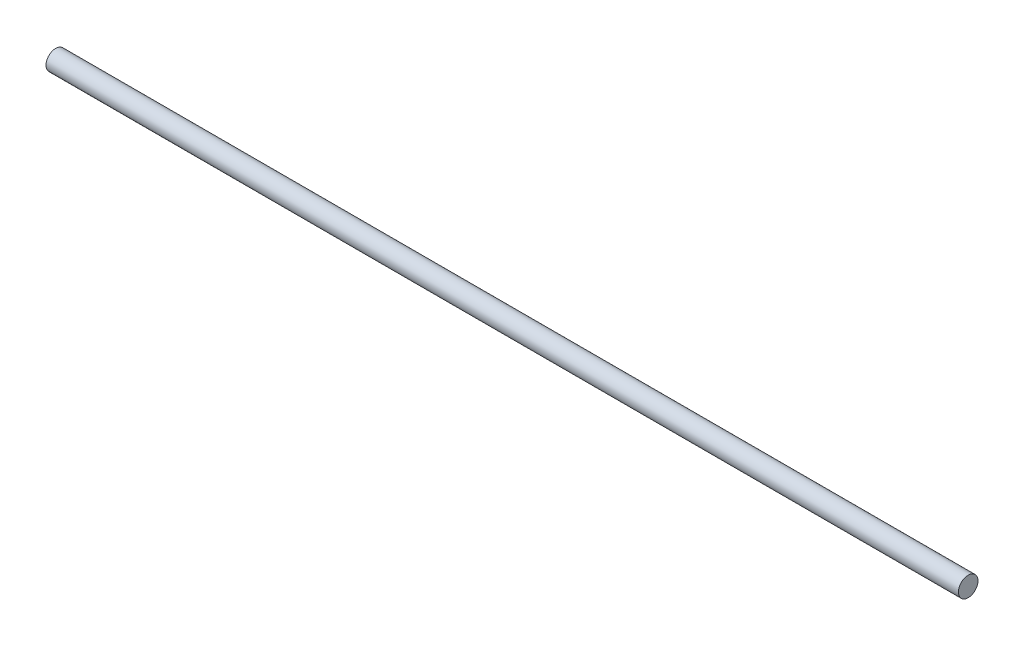
ISO-10303-21;
HEADER;
FILE_DESCRIPTION(('STEP AP214'),'2;1');
FILE_NAME('part.step','',(''),(''),'','','');
FILE_SCHEMA(('AUTOMOTIVE_DESIGN { 1 0 10303 214 1 1 1 1 }'));
ENDSEC;
DATA;
#1=APPLICATION_CONTEXT('core data for automotive mechanical design processes');
#2=APPLICATION_PROTOCOL_DEFINITION('international standard','automotive_design',2000,#1);
#3=PRODUCT_CONTEXT('',#1,'mechanical');
#4=PRODUCT('Part','Part','',(#3));
#5=PRODUCT_RELATED_PRODUCT_CATEGORY('part','',(#4));
#6=PRODUCT_DEFINITION_FORMATION('','',#4);
#7=PRODUCT_DEFINITION_CONTEXT('part definition',#1,'design');
#8=PRODUCT_DEFINITION('design','',#6,#7);
#9=PRODUCT_DEFINITION_SHAPE('','',#8);
#10=(LENGTH_UNIT() NAMED_UNIT(*) SI_UNIT(.MILLI.,.METRE.));
#11=(NAMED_UNIT(*) PLANE_ANGLE_UNIT() SI_UNIT($,.RADIAN.));
#12=(NAMED_UNIT(*) SI_UNIT($,.STERADIAN.) SOLID_ANGLE_UNIT());
#13=UNCERTAINTY_MEASURE_WITH_UNIT(LENGTH_MEASURE(1.E-05),#10,'distance_accuracy_value','');
#14=(GEOMETRIC_REPRESENTATION_CONTEXT(3) GLOBAL_UNCERTAINTY_ASSIGNED_CONTEXT((#13)) GLOBAL_UNIT_ASSIGNED_CONTEXT((#10,
#11,#12)) REPRESENTATION_CONTEXT('',''));
#15=CARTESIAN_POINT('',(0.,0.,0.));
#16=DIRECTION('',(0.,0.,1.));
#17=DIRECTION('',(1.,0.,0.));
#18=AXIS2_PLACEMENT_3D('',#15,#16,#17);
#19=CARTESIAN_POINT('',(355.6,0.,0.));
#20=DIRECTION('',(-1.,0.,0.));
#21=DIRECTION('',(0.,0.,1.));
#22=AXIS2_PLACEMENT_3D('',#19,#20,#21);
#23=CYLINDRICAL_SURFACE('',#22,3.81);
#24=CARTESIAN_POINT('',(355.6,0.,0.));
#25=DIRECTION('',(1.,0.,0.));
#26=DIRECTION('',(0.,0.,-1.));
#27=AXIS2_PLACEMENT_3D('',#24,#25,#26);
#28=CIRCLE('',#27,3.81);
#29=CARTESIAN_POINT('',(355.6,0.,-3.81));
#30=VERTEX_POINT('',#29);
#31=EDGE_CURVE('E10',#30,#30,#28,.T.);
#32=ORIENTED_EDGE('',*,*,#31,.F.);
#33=EDGE_LOOP('',(#32));
#34=FACE_BOUND('',#33,.T.);
#35=CARTESIAN_POINT('',(0.,0.,0.));
#36=DIRECTION('',(1.,0.,0.));
#37=DIRECTION('',(0.,0.,-1.));
#38=AXIS2_PLACEMENT_3D('',#35,#36,#37);
#39=CIRCLE('',#38,3.81);
#40=CARTESIAN_POINT('',(0.,0.,-3.81));
#41=VERTEX_POINT('',#40);
#42=EDGE_CURVE('E34',#41,#41,#39,.T.);
#43=ORIENTED_EDGE('',*,*,#42,.T.);
#44=EDGE_LOOP('',(#43));
#45=FACE_BOUND('',#44,.T.);
#46=ADVANCED_FACE('F31',(#34,#45),#23,.T.);
#47=CARTESIAN_POINT('',(355.6,0.,0.));
#48=DIRECTION('',(1.,0.,0.));
#49=DIRECTION('',(0.,0.,-1.));
#50=AXIS2_PLACEMENT_3D('',#47,#48,#49);
#51=PLANE('',#50);
#52=ORIENTED_EDGE('',*,*,#31,.T.);
#53=EDGE_LOOP('',(#52));
#54=FACE_BOUND('',#53,.T.);
#55=ADVANCED_FACE('F46',(#54),#51,.T.);
#56=CARTESIAN_POINT('',(0.,0.,0.));
#57=DIRECTION('',(1.,0.,0.));
#58=DIRECTION('',(0.,0.,-1.));
#59=AXIS2_PLACEMENT_3D('',#56,#57,#58);
#60=PLANE('',#59);
#61=ORIENTED_EDGE('',*,*,#42,.F.);
#62=EDGE_LOOP('',(#61));
#63=FACE_BOUND('',#62,.T.);
#64=ADVANCED_FACE('F44',(#63),#60,.F.);
#65=CLOSED_SHELL('',(#46,#55,#64));
#66=MANIFOLD_SOLID_BREP('B2',#65);
#67=ADVANCED_BREP_SHAPE_REPRESENTATION('',(#18,#66),#14);
#68=SHAPE_DEFINITION_REPRESENTATION(#9,#67);
ENDSEC;
END-ISO-10303-21;
